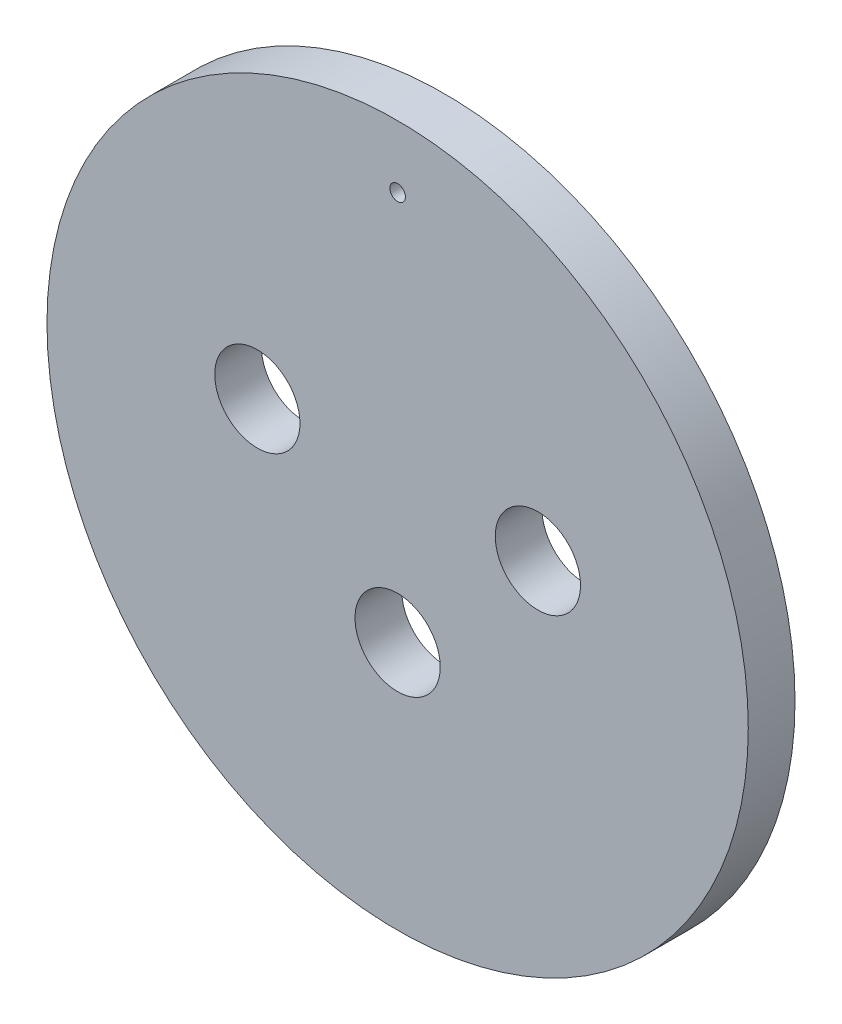
ISO-10303-21;
HEADER;
FILE_DESCRIPTION(('STEP AP214'),'2;1');
FILE_NAME('part.step','',(''),(''),'','','');
FILE_SCHEMA(('AUTOMOTIVE_DESIGN { 1 0 10303 214 1 1 1 1 }'));
ENDSEC;
DATA;
#1=APPLICATION_CONTEXT('core data for automotive mechanical design processes');
#2=APPLICATION_PROTOCOL_DEFINITION('international standard','automotive_design',2000,#1);
#3=PRODUCT_CONTEXT('',#1,'mechanical');
#4=PRODUCT('Part','Part','',(#3));
#5=PRODUCT_RELATED_PRODUCT_CATEGORY('part','',(#4));
#6=PRODUCT_DEFINITION_FORMATION('','',#4);
#7=PRODUCT_DEFINITION_CONTEXT('part definition',#1,'design');
#8=PRODUCT_DEFINITION('design','',#6,#7);
#9=PRODUCT_DEFINITION_SHAPE('','',#8);
#10=(LENGTH_UNIT() NAMED_UNIT(*) SI_UNIT(.MILLI.,.METRE.));
#11=(NAMED_UNIT(*) PLANE_ANGLE_UNIT() SI_UNIT($,.RADIAN.));
#12=(NAMED_UNIT(*) SI_UNIT($,.STERADIAN.) SOLID_ANGLE_UNIT());
#13=UNCERTAINTY_MEASURE_WITH_UNIT(LENGTH_MEASURE(1.E-05),#10,'distance_accuracy_value','');
#14=(GEOMETRIC_REPRESENTATION_CONTEXT(3) GLOBAL_UNCERTAINTY_ASSIGNED_CONTEXT((#13)) GLOBAL_UNIT_ASSIGNED_CONTEXT((#10,
#11,#12)) REPRESENTATION_CONTEXT('',''));
#15=CARTESIAN_POINT('',(0.,0.,0.));
#16=DIRECTION('',(0.,0.,1.));
#17=DIRECTION('',(1.,0.,0.));
#18=AXIS2_PLACEMENT_3D('',#15,#16,#17);
#19=CARTESIAN_POINT('',(0.,0.,3.));
#20=DIRECTION('',(0.,0.,-1.));
#21=DIRECTION('',(-1.,0.,0.));
#22=AXIS2_PLACEMENT_3D('',#19,#20,#21);
#23=CYLINDRICAL_SURFACE('',#22,22.5);
#24=CARTESIAN_POINT('',(0.,0.,3.));
#25=DIRECTION('',(0.,0.,1.));
#26=DIRECTION('',(1.,0.,0.));
#27=AXIS2_PLACEMENT_3D('',#24,#25,#26);
#28=CIRCLE('',#27,22.5);
#29=CARTESIAN_POINT('',(22.5,0.,3.));
#30=VERTEX_POINT('',#29);
#31=EDGE_CURVE('E10',#30,#30,#28,.T.);
#32=ORIENTED_EDGE('',*,*,#31,.F.);
#33=EDGE_LOOP('',(#32));
#34=FACE_BOUND('',#33,.T.);
#35=CARTESIAN_POINT('',(0.,0.,0.));
#36=DIRECTION('',(0.,0.,1.));
#37=DIRECTION('',(1.,0.,0.));
#38=AXIS2_PLACEMENT_3D('',#35,#36,#37);
#39=CIRCLE('',#38,22.5);
#40=CARTESIAN_POINT('',(22.5,0.,0.));
#41=VERTEX_POINT('',#40);
#42=EDGE_CURVE('E44',#41,#41,#39,.T.);
#43=ORIENTED_EDGE('',*,*,#42,.T.);
#44=EDGE_LOOP('',(#43));
#45=FACE_BOUND('',#44,.T.);
#46=ADVANCED_FACE('F41',(#34,#45),#23,.T.);
#47=CARTESIAN_POINT('',(0.,0.,3.));
#48=DIRECTION('',(0.,0.,1.));
#49=DIRECTION('',(1.,0.,0.));
#50=AXIS2_PLACEMENT_3D('',#47,#48,#49);
#51=PLANE('',#50);
#52=CARTESIAN_POINT('',(9.,2.535,3.));
#53=DIRECTION('',(0.,0.,1.));
#54=DIRECTION('',(1.,0.,0.));
#55=AXIS2_PLACEMENT_3D('',#52,#53,#54);
#56=CIRCLE('',#55,2.735);
#57=CARTESIAN_POINT('',(11.735,2.535,3.));
#58=VERTEX_POINT('',#57);
#59=EDGE_CURVE('E79',#58,#58,#56,.T.);
#60=ORIENTED_EDGE('',*,*,#59,.F.);
#61=EDGE_LOOP('',(#60));
#62=FACE_BOUND('',#61,.T.);
#63=CARTESIAN_POINT('',(-9.,2.535,3.));
#64=DIRECTION('',(0.,0.,1.));
#65=DIRECTION('',(1.,0.,0.));
#66=AXIS2_PLACEMENT_3D('',#63,#64,#65);
#67=CIRCLE('',#66,2.735);
#68=CARTESIAN_POINT('',(-6.265,2.535,3.));
#69=VERTEX_POINT('',#68);
#70=EDGE_CURVE('E75',#69,#69,#67,.T.);
#71=ORIENTED_EDGE('',*,*,#70,.F.);
#72=EDGE_LOOP('',(#71));
#73=FACE_BOUND('',#72,.T.);
#74=CARTESIAN_POINT('',(0.,-6.5,3.));
#75=DIRECTION('',(0.,0.,1.));
#76=DIRECTION('',(1.,0.,0.));
#77=AXIS2_PLACEMENT_3D('',#74,#75,#76);
#78=CIRCLE('',#77,2.735);
#79=CARTESIAN_POINT('',(2.735,-6.5,3.));
#80=VERTEX_POINT('',#79);
#81=EDGE_CURVE('E67',#80,#80,#78,.T.);
#82=ORIENTED_EDGE('',*,*,#81,.F.);
#83=EDGE_LOOP('',(#82));
#84=FACE_BOUND('',#83,.T.);
#85=CARTESIAN_POINT('',(0.,18.5,3.));
#86=DIRECTION('',(0.,0.,1.));
#87=DIRECTION('',(1.,0.,0.));
#88=AXIS2_PLACEMENT_3D('',#85,#86,#87);
#89=CIRCLE('',#88,0.5);
#90=CARTESIAN_POINT('',(0.5,18.5,3.));
#91=VERTEX_POINT('',#90);
#92=EDGE_CURVE('E59',#91,#91,#89,.T.);
#93=ORIENTED_EDGE('',*,*,#92,.F.);
#94=EDGE_LOOP('',(#93));
#95=FACE_BOUND('',#94,.T.);
#96=ORIENTED_EDGE('',*,*,#31,.T.);
#97=EDGE_LOOP('',(#96));
#98=FACE_BOUND('',#97,.T.);
#99=ADVANCED_FACE('F97',(#62,#73,#84,#95,#98),#51,.T.);
#100=CARTESIAN_POINT('',(0.,0.,0.));
#101=DIRECTION('',(0.,0.,1.));
#102=DIRECTION('',(1.,0.,0.));
#103=AXIS2_PLACEMENT_3D('',#100,#101,#102);
#104=PLANE('',#103);
#105=CARTESIAN_POINT('',(9.,2.535,0.));
#106=DIRECTION('',(0.,0.,1.));
#107=DIRECTION('',(1.,0.,0.));
#108=AXIS2_PLACEMENT_3D('',#105,#106,#107);
#109=CIRCLE('',#108,2.735);
#110=CARTESIAN_POINT('',(11.735,2.535,0.));
#111=VERTEX_POINT('',#110);
#112=EDGE_CURVE('E53',#111,#111,#109,.T.);
#113=ORIENTED_EDGE('',*,*,#112,.T.);
#114=EDGE_LOOP('',(#113));
#115=FACE_BOUND('',#114,.T.);
#116=CARTESIAN_POINT('',(-9.,2.535,0.));
#117=DIRECTION('',(0.,0.,1.));
#118=DIRECTION('',(1.,0.,0.));
#119=AXIS2_PLACEMENT_3D('',#116,#117,#118);
#120=CIRCLE('',#119,2.735);
#121=CARTESIAN_POINT('',(-6.265,2.535,0.));
#122=VERTEX_POINT('',#121);
#123=EDGE_CURVE('E71',#122,#122,#120,.T.);
#124=ORIENTED_EDGE('',*,*,#123,.T.);
#125=EDGE_LOOP('',(#124));
#126=FACE_BOUND('',#125,.T.);
#127=CARTESIAN_POINT('',(0.,-6.5,0.));
#128=DIRECTION('',(0.,0.,1.));
#129=DIRECTION('',(1.,0.,0.));
#130=AXIS2_PLACEMENT_3D('',#127,#128,#129);
#131=CIRCLE('',#130,2.735);
#132=CARTESIAN_POINT('',(2.735,-6.5,0.));
#133=VERTEX_POINT('',#132);
#134=EDGE_CURVE('E63',#133,#133,#131,.T.);
#135=ORIENTED_EDGE('',*,*,#134,.T.);
#136=EDGE_LOOP('',(#135));
#137=FACE_BOUND('',#136,.T.);
#138=CARTESIAN_POINT('',(0.,18.5,0.));
#139=DIRECTION('',(0.,0.,1.));
#140=DIRECTION('',(1.,0.,0.));
#141=AXIS2_PLACEMENT_3D('',#138,#139,#140);
#142=CIRCLE('',#141,0.5);
#143=CARTESIAN_POINT('',(0.5,18.5,0.));
#144=VERTEX_POINT('',#143);
#145=EDGE_CURVE('E55',#144,#144,#142,.T.);
#146=ORIENTED_EDGE('',*,*,#145,.T.);
#147=EDGE_LOOP('',(#146));
#148=FACE_BOUND('',#147,.T.);
#149=ORIENTED_EDGE('',*,*,#42,.F.);
#150=EDGE_LOOP('',(#149));
#151=FACE_BOUND('',#150,.T.);
#152=ADVANCED_FACE('F87',(#115,#126,#137,#148,#151),#104,.F.);
#153=CARTESIAN_POINT('',(0.,18.5,0.));
#154=DIRECTION('',(0.,0.,1.));
#155=DIRECTION('',(1.,0.,0.));
#156=AXIS2_PLACEMENT_3D('',#153,#154,#155);
#157=CYLINDRICAL_SURFACE('',#156,0.5);
#158=ORIENTED_EDGE('',*,*,#145,.F.);
#159=EDGE_LOOP('',(#158));
#160=FACE_BOUND('',#159,.T.);
#161=ORIENTED_EDGE('',*,*,#92,.T.);
#162=EDGE_LOOP('',(#161));
#163=FACE_BOUND('',#162,.T.);
#164=ADVANCED_FACE('F107',(#160,#163),#157,.F.);
#165=CARTESIAN_POINT('',(0.,-6.5,0.));
#166=DIRECTION('',(0.,0.,1.));
#167=DIRECTION('',(1.,0.,0.));
#168=AXIS2_PLACEMENT_3D('',#165,#166,#167);
#169=CYLINDRICAL_SURFACE('',#168,2.735);
#170=ORIENTED_EDGE('',*,*,#134,.F.);
#171=EDGE_LOOP('',(#170));
#172=FACE_BOUND('',#171,.T.);
#173=ORIENTED_EDGE('',*,*,#81,.T.);
#174=EDGE_LOOP('',(#173));
#175=FACE_BOUND('',#174,.T.);
#176=ADVANCED_FACE('F109',(#172,#175),#169,.F.);
#177=CARTESIAN_POINT('',(-9.,2.535,0.));
#178=DIRECTION('',(0.,0.,1.));
#179=DIRECTION('',(1.,0.,0.));
#180=AXIS2_PLACEMENT_3D('',#177,#178,#179);
#181=CYLINDRICAL_SURFACE('',#180,2.735);
#182=ORIENTED_EDGE('',*,*,#123,.F.);
#183=EDGE_LOOP('',(#182));
#184=FACE_BOUND('',#183,.T.);
#185=ORIENTED_EDGE('',*,*,#70,.T.);
#186=EDGE_LOOP('',(#185));
#187=FACE_BOUND('',#186,.T.);
#188=ADVANCED_FACE('F93',(#184,#187),#181,.F.);
#189=CARTESIAN_POINT('',(9.,2.535,0.));
#190=DIRECTION('',(0.,0.,1.));
#191=DIRECTION('',(1.,0.,0.));
#192=AXIS2_PLACEMENT_3D('',#189,#190,#191);
#193=CYLINDRICAL_SURFACE('',#192,2.735);
#194=ORIENTED_EDGE('',*,*,#112,.F.);
#195=EDGE_LOOP('',(#194));
#196=FACE_BOUND('',#195,.T.);
#197=ORIENTED_EDGE('',*,*,#59,.T.);
#198=EDGE_LOOP('',(#197));
#199=FACE_BOUND('',#198,.T.);
#200=ADVANCED_FACE('F90',(#196,#199),#193,.F.);
#201=CLOSED_SHELL('',(#46,#99,#152,#164,#176,#188,#200));
#202=MANIFOLD_SOLID_BREP('B2',#201);
#203=ADVANCED_BREP_SHAPE_REPRESENTATION('',(#18,#202),#14);
#204=SHAPE_DEFINITION_REPRESENTATION(#9,#203);
ENDSEC;
END-ISO-10303-21;
